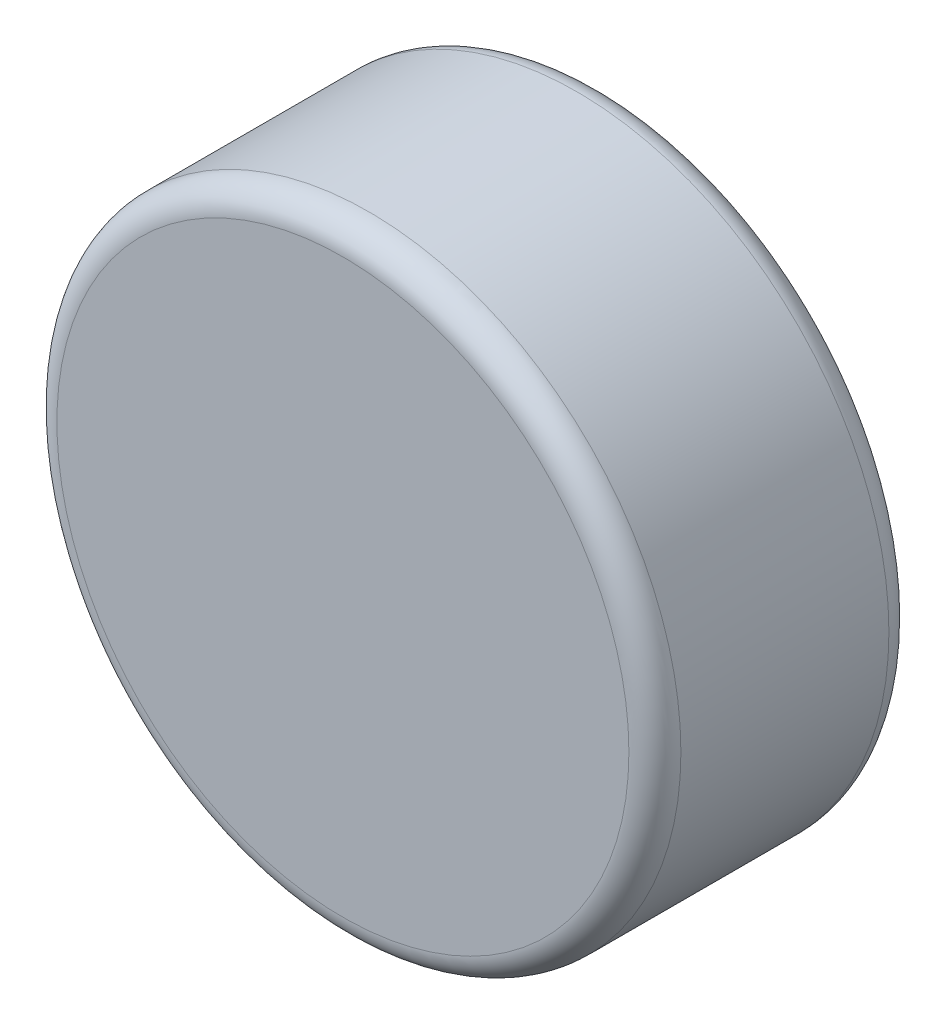
ISO-10303-21;
HEADER;
FILE_DESCRIPTION(('STEP AP214'),'2;1');
FILE_NAME('part.step','',(''),(''),'','','');
FILE_SCHEMA(('AUTOMOTIVE_DESIGN { 1 0 10303 214 1 1 1 1 }'));
ENDSEC;
DATA;
#1=APPLICATION_CONTEXT('core data for automotive mechanical design processes');
#2=APPLICATION_PROTOCOL_DEFINITION('international standard','automotive_design',2000,#1);
#3=PRODUCT_CONTEXT('',#1,'mechanical');
#4=PRODUCT('Part','Part','',(#3));
#5=PRODUCT_RELATED_PRODUCT_CATEGORY('part','',(#4));
#6=PRODUCT_DEFINITION_FORMATION('','',#4);
#7=PRODUCT_DEFINITION_CONTEXT('part definition',#1,'design');
#8=PRODUCT_DEFINITION('design','',#6,#7);
#9=PRODUCT_DEFINITION_SHAPE('','',#8);
#10=(LENGTH_UNIT() NAMED_UNIT(*) SI_UNIT(.MILLI.,.METRE.));
#11=(NAMED_UNIT(*) PLANE_ANGLE_UNIT() SI_UNIT($,.RADIAN.));
#12=(NAMED_UNIT(*) SI_UNIT($,.STERADIAN.) SOLID_ANGLE_UNIT());
#13=UNCERTAINTY_MEASURE_WITH_UNIT(LENGTH_MEASURE(1.E-05),#10,'distance_accuracy_value','');
#14=(GEOMETRIC_REPRESENTATION_CONTEXT(3) GLOBAL_UNCERTAINTY_ASSIGNED_CONTEXT((#13)) GLOBAL_UNIT_ASSIGNED_CONTEXT((#10,
#11,#12)) REPRESENTATION_CONTEXT('',''));
#15=CARTESIAN_POINT('',(0.,0.,0.));
#16=DIRECTION('',(0.,0.,1.));
#17=DIRECTION('',(1.,0.,0.));
#18=AXIS2_PLACEMENT_3D('',#15,#16,#17);
#19=CARTESIAN_POINT('',(0.,0.,1.25));
#20=DIRECTION('',(0.,0.,-1.));
#21=DIRECTION('',(-1.,0.,0.));
#22=AXIS2_PLACEMENT_3D('',#19,#20,#21);
#23=CYLINDRICAL_SURFACE('',#22,3.);
#24=CARTESIAN_POINT('',(0.,0.,1.));
#25=DIRECTION('',(0.,0.,1.));
#26=DIRECTION('',(1.,0.,0.));
#27=AXIS2_PLACEMENT_3D('',#24,#25,#26);
#28=CIRCLE('',#27,3.);
#29=CARTESIAN_POINT('',(3.,0.,1.));
#30=VERTEX_POINT('',#29);
#31=EDGE_CURVE('E44',#30,#30,#28,.F.);
#32=ORIENTED_EDGE('',*,*,#31,.T.);
#33=EDGE_LOOP('',(#32));
#34=FACE_BOUND('',#33,.T.);
#35=CARTESIAN_POINT('',(0.,0.,-1.));
#36=DIRECTION('',(0.,0.,1.));
#37=DIRECTION('',(1.,0.,0.));
#38=AXIS2_PLACEMENT_3D('',#35,#36,#37);
#39=CIRCLE('',#38,3.);
#40=CARTESIAN_POINT('',(3.,0.,-1.));
#41=VERTEX_POINT('',#40);
#42=EDGE_CURVE('E48',#41,#41,#39,.T.);
#43=ORIENTED_EDGE('',*,*,#42,.T.);
#44=EDGE_LOOP('',(#43));
#45=FACE_BOUND('',#44,.T.);
#46=ADVANCED_FACE('F37',(#34,#45),#23,.T.);
#47=CARTESIAN_POINT('',(0.,0.,1.25));
#48=DIRECTION('',(0.,0.,1.));
#49=DIRECTION('',(1.,0.,0.));
#50=AXIS2_PLACEMENT_3D('',#47,#48,#49);
#51=PLANE('',#50);
#52=CARTESIAN_POINT('',(0.,0.,1.25));
#53=DIRECTION('',(0.,0.,1.));
#54=DIRECTION('',(1.,0.,0.));
#55=AXIS2_PLACEMENT_3D('',#52,#53,#54);
#56=CIRCLE('',#55,2.75);
#57=CARTESIAN_POINT('',(2.75,0.,1.25));
#58=VERTEX_POINT('',#57);
#59=EDGE_CURVE('E52',#58,#58,#56,.T.);
#60=ORIENTED_EDGE('',*,*,#59,.T.);
#61=EDGE_LOOP('',(#60));
#62=FACE_BOUND('',#61,.T.);
#63=ADVANCED_FACE('F58',(#62),#51,.T.);
#64=CARTESIAN_POINT('',(0.,0.,-1.25));
#65=DIRECTION('',(0.,0.,1.));
#66=DIRECTION('',(1.,0.,0.));
#67=AXIS2_PLACEMENT_3D('',#64,#65,#66);
#68=PLANE('',#67);
#69=CARTESIAN_POINT('',(0.,0.,-1.25));
#70=DIRECTION('',(0.,0.,1.));
#71=DIRECTION('',(1.,0.,0.));
#72=AXIS2_PLACEMENT_3D('',#69,#70,#71);
#73=CIRCLE('',#72,2.75);
#74=CARTESIAN_POINT('',(2.75,0.,-1.25));
#75=VERTEX_POINT('',#74);
#76=EDGE_CURVE('E10',#75,#75,#73,.F.);
#77=ORIENTED_EDGE('',*,*,#76,.T.);
#78=EDGE_LOOP('',(#77));
#79=FACE_BOUND('',#78,.T.);
#80=ADVANCED_FACE('F62',(#79),#68,.F.);
#81=CARTESIAN_POINT('',(0.,0.,1.));
#82=DIRECTION('',(0.,0.,1.));
#83=DIRECTION('',(1.,0.,0.));
#84=AXIS2_PLACEMENT_3D('',#81,#82,#83);
#85=TOROIDAL_SURFACE('',#84,2.75,0.25);
#86=ORIENTED_EDGE('',*,*,#31,.F.);
#87=EDGE_LOOP('',(#86));
#88=FACE_BOUND('',#87,.T.);
#89=ORIENTED_EDGE('',*,*,#59,.F.);
#90=EDGE_LOOP('',(#89));
#91=FACE_BOUND('',#90,.T.);
#92=ADVANCED_FACE('F60',(#88,#91),#85,.T.);
#93=CARTESIAN_POINT('',(0.,0.,-1.));
#94=DIRECTION('',(0.,0.,1.));
#95=DIRECTION('',(1.,0.,0.));
#96=AXIS2_PLACEMENT_3D('',#93,#94,#95);
#97=TOROIDAL_SURFACE('',#96,2.75,0.25);
#98=ORIENTED_EDGE('',*,*,#76,.F.);
#99=EDGE_LOOP('',(#98));
#100=FACE_BOUND('',#99,.T.);
#101=ORIENTED_EDGE('',*,*,#42,.F.);
#102=EDGE_LOOP('',(#101));
#103=FACE_BOUND('',#102,.T.);
#104=ADVANCED_FACE('F39',(#100,#103),#97,.T.);
#105=CLOSED_SHELL('',(#46,#63,#80,#92,#104));
#106=MANIFOLD_SOLID_BREP('B2',#105);
#107=ADVANCED_BREP_SHAPE_REPRESENTATION('',(#18,#106),#14);
#108=SHAPE_DEFINITION_REPRESENTATION(#9,#107);
ENDSEC;
END-ISO-10303-21;
